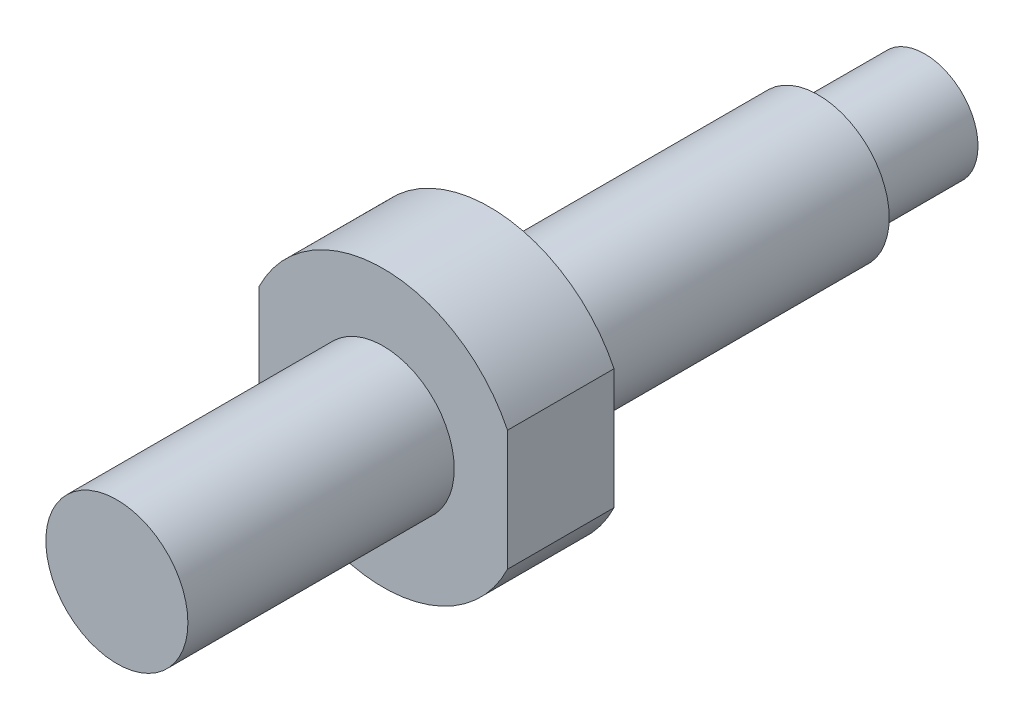
ISO-10303-21;
HEADER;
FILE_DESCRIPTION(('STEP AP214'),'2;1');
FILE_NAME('part.step','',(''),(''),'','','');
FILE_SCHEMA(('AUTOMOTIVE_DESIGN { 1 0 10303 214 1 1 1 1 }'));
ENDSEC;
DATA;
#1=APPLICATION_CONTEXT('core data for automotive mechanical design processes');
#2=APPLICATION_PROTOCOL_DEFINITION('international standard','automotive_design',2000,#1);
#3=PRODUCT_CONTEXT('',#1,'mechanical');
#4=PRODUCT('Part','Part','',(#3));
#5=PRODUCT_RELATED_PRODUCT_CATEGORY('part','',(#4));
#6=PRODUCT_DEFINITION_FORMATION('','',#4);
#7=PRODUCT_DEFINITION_CONTEXT('part definition',#1,'design');
#8=PRODUCT_DEFINITION('design','',#6,#7);
#9=PRODUCT_DEFINITION_SHAPE('','',#8);
#10=(LENGTH_UNIT() NAMED_UNIT(*) SI_UNIT(.MILLI.,.METRE.));
#11=(NAMED_UNIT(*) PLANE_ANGLE_UNIT() SI_UNIT($,.RADIAN.));
#12=(NAMED_UNIT(*) SI_UNIT($,.STERADIAN.) SOLID_ANGLE_UNIT());
#13=UNCERTAINTY_MEASURE_WITH_UNIT(LENGTH_MEASURE(1.E-05),#10,'distance_accuracy_value','');
#14=(GEOMETRIC_REPRESENTATION_CONTEXT(3) GLOBAL_UNCERTAINTY_ASSIGNED_CONTEXT((#13)) GLOBAL_UNIT_ASSIGNED_CONTEXT((#10,
#11,#12)) REPRESENTATION_CONTEXT('',''));
#15=CARTESIAN_POINT('',(0.,0.,0.));
#16=DIRECTION('',(0.,0.,1.));
#17=DIRECTION('',(1.,0.,0.));
#18=AXIS2_PLACEMENT_3D('',#15,#16,#17);
#19=CARTESIAN_POINT('',(0.,4.,-39.5));
#20=DIRECTION('',(0.,0.,1.));
#21=DIRECTION('',(1.,0.,0.));
#22=AXIS2_PLACEMENT_3D('',#19,#20,#21);
#23=PLANE('',#22);
#24=CARTESIAN_POINT('',(0.,0.,-39.5));
#25=DIRECTION('',(0.,0.,1.));
#26=DIRECTION('',(1.,0.,0.));
#27=AXIS2_PLACEMENT_3D('',#24,#25,#26);
#28=CIRCLE('',#27,4.);
#29=CARTESIAN_POINT('',(4.,0.,-39.5));
#30=VERTEX_POINT('',#29);
#31=EDGE_CURVE('E125',#30,#30,#28,.T.);
#32=ORIENTED_EDGE('',*,*,#31,.F.);
#33=EDGE_LOOP('',(#32));
#34=FACE_BOUND('',#33,.T.);
#35=CARTESIAN_POINT('',(0.,0.,-39.5));
#36=DIRECTION('',(0.,0.,1.));
#37=DIRECTION('',(1.,0.,0.));
#38=AXIS2_PLACEMENT_3D('',#35,#36,#37);
#39=CIRCLE('',#38,3.);
#40=CARTESIAN_POINT('',(3.,0.,-39.5));
#41=VERTEX_POINT('',#40);
#42=EDGE_CURVE('E12',#41,#41,#39,.F.);
#43=ORIENTED_EDGE('',*,*,#42,.F.);
#44=EDGE_LOOP('',(#43));
#45=FACE_BOUND('',#44,.T.);
#46=ADVANCED_FACE('F40',(#34,#45),#23,.F.);
#47=CARTESIAN_POINT('',(0.,4.,-15.));
#48=DIRECTION('',(0.,0.,-1.));
#49=DIRECTION('',(-1.,0.,0.));
#50=AXIS2_PLACEMENT_3D('',#47,#48,#49);
#51=PLANE('',#50);
#52=CARTESIAN_POINT('',(0.,0.,-15.));
#53=DIRECTION('',(0.,0.,1.));
#54=DIRECTION('',(1.,0.,0.));
#55=AXIS2_PLACEMENT_3D('',#52,#53,#54);
#56=CIRCLE('',#55,4.);
#57=CARTESIAN_POINT('',(4.,0.,-15.));
#58=VERTEX_POINT('',#57);
#59=EDGE_CURVE('E106',#58,#58,#56,.T.);
#60=ORIENTED_EDGE('',*,*,#59,.F.);
#61=EDGE_LOOP('',(#60));
#62=FACE_BOUND('',#61,.T.);
#63=CARTESIAN_POINT('',(0.,0.,-15.));
#64=DIRECTION('',(0.,0.,-1.));
#65=DIRECTION('',(-1.,0.,0.));
#66=AXIS2_PLACEMENT_3D('',#63,#64,#65);
#67=CIRCLE('',#66,7.77784742024014);
#68=CARTESIAN_POINT('',(-7.,3.39041450158181,-15.));
#69=VERTEX_POINT('',#68);
#70=CARTESIAN_POINT('',(7.,3.39041450158181,-15.));
#71=VERTEX_POINT('',#70);
#72=EDGE_CURVE('E82',#69,#71,#67,.T.);
#73=ORIENTED_EDGE('',*,*,#72,.F.);
#74=DIRECTION('',(0.,1.,0.));
#75=VECTOR('',#74,1.);
#76=CARTESIAN_POINT('',(-7.,-8.43799237337698,-15.));
#77=LINE('',#76,#75);
#78=CARTESIAN_POINT('',(-7.,-3.39041450158181,-15.));
#79=VERTEX_POINT('',#78);
#80=EDGE_CURVE('E116',#79,#69,#77,.T.);
#81=ORIENTED_EDGE('',*,*,#80,.F.);
#82=CARTESIAN_POINT('',(7.,-3.39041450158181,-15.));
#83=VERTEX_POINT('',#82);
#84=EDGE_CURVE('E55',#83,#79,#67,.T.);
#85=ORIENTED_EDGE('',*,*,#84,.F.);
#86=DIRECTION('',(0.,-1.,0.));
#87=VECTOR('',#86,1.);
#88=CARTESIAN_POINT('',(7.,-8.43799237337698,-15.));
#89=LINE('',#88,#87);
#90=EDGE_CURVE('E119',#71,#83,#89,.T.);
#91=ORIENTED_EDGE('',*,*,#90,.F.);
#92=EDGE_LOOP('',(#73,#81,#85,#91));
#93=FACE_BOUND('',#92,.T.);
#94=ADVANCED_FACE('F118',(#62,#93),#51,.F.);
#95=CARTESIAN_POINT('',(0.,9.,-21.));
#96=DIRECTION('',(0.,0.,1.));
#97=DIRECTION('',(1.,0.,0.));
#98=AXIS2_PLACEMENT_3D('',#95,#96,#97);
#99=PLANE('',#98);
#100=CARTESIAN_POINT('',(0.,0.,-21.));
#101=DIRECTION('',(0.,0.,1.));
#102=DIRECTION('',(1.,0.,0.));
#103=AXIS2_PLACEMENT_3D('',#100,#101,#102);
#104=CIRCLE('',#103,4.);
#105=CARTESIAN_POINT('',(4.,0.,-21.));
#106=VERTEX_POINT('',#105);
#107=EDGE_CURVE('E128',#106,#106,#104,.T.);
#108=ORIENTED_EDGE('',*,*,#107,.T.);
#109=EDGE_LOOP('',(#108));
#110=FACE_BOUND('',#109,.T.);
#111=CARTESIAN_POINT('',(0.,0.,-21.));
#112=DIRECTION('',(0.,0.,-1.));
#113=DIRECTION('',(-1.,0.,0.));
#114=AXIS2_PLACEMENT_3D('',#111,#112,#113);
#115=CIRCLE('',#114,7.77784742024014);
#116=CARTESIAN_POINT('',(-7.,3.39041450158181,-21.));
#117=VERTEX_POINT('',#116);
#118=CARTESIAN_POINT('',(7.,3.39041450158181,-21.));
#119=VERTEX_POINT('',#118);
#120=EDGE_CURVE('E63',#117,#119,#115,.T.);
#121=ORIENTED_EDGE('',*,*,#120,.T.);
#122=DIRECTION('',(0.,-1.,0.));
#123=VECTOR('',#122,1.);
#124=CARTESIAN_POINT('',(7.,9.,-21.));
#125=LINE('',#124,#123);
#126=CARTESIAN_POINT('',(7.,-3.39041450158181,-21.));
#127=VERTEX_POINT('',#126);
#128=EDGE_CURVE('E93',#119,#127,#125,.T.);
#129=ORIENTED_EDGE('',*,*,#128,.T.);
#130=CARTESIAN_POINT('',(-7.,-3.39041450158181,-21.));
#131=VERTEX_POINT('',#130);
#132=EDGE_CURVE('E96',#127,#131,#115,.T.);
#133=ORIENTED_EDGE('',*,*,#132,.T.);
#134=DIRECTION('',(0.,1.,0.));
#135=VECTOR('',#134,1.);
#136=CARTESIAN_POINT('',(-7.,9.,-21.));
#137=LINE('',#136,#135);
#138=EDGE_CURVE('E95',#131,#117,#137,.T.);
#139=ORIENTED_EDGE('',*,*,#138,.T.);
#140=EDGE_LOOP('',(#121,#129,#133,#139));
#141=FACE_BOUND('',#140,.T.);
#142=ADVANCED_FACE('F91',(#110,#141),#99,.F.);
#143=CARTESIAN_POINT('',(7.,-8.43799237337698,-25.));
#144=DIRECTION('',(-1.,0.,0.));
#145=DIRECTION('',(0.,0.,1.));
#146=AXIS2_PLACEMENT_3D('',#143,#144,#145);
#147=PLANE('',#146);
#148=DIRECTION('',(0.,0.,-1.));
#149=VECTOR('',#148,1.);
#150=CARTESIAN_POINT('',(7.,3.39041450158181,-11.));
#151=LINE('',#150,#149);
#152=EDGE_CURVE('E79',#71,#119,#151,.T.);
#153=ORIENTED_EDGE('',*,*,#152,.F.);
#154=ORIENTED_EDGE('',*,*,#90,.T.);
#155=DIRECTION('',(0.,0.,-1.));
#156=VECTOR('',#155,1.);
#157=CARTESIAN_POINT('',(7.,-3.39041450158181,-11.));
#158=LINE('',#157,#156);
#159=EDGE_CURVE('E100',#127,#83,#158,.F.);
#160=ORIENTED_EDGE('',*,*,#159,.F.);
#161=ORIENTED_EDGE('',*,*,#128,.F.);
#162=EDGE_LOOP('',(#153,#154,#160,#161));
#163=FACE_BOUND('',#162,.T.);
#164=ADVANCED_FACE('F99',(#163),#147,.F.);
#165=CARTESIAN_POINT('',(-7.,-8.43799237337698,-25.));
#166=DIRECTION('',(1.,0.,0.));
#167=DIRECTION('',(0.,0.,-1.));
#168=AXIS2_PLACEMENT_3D('',#165,#166,#167);
#169=PLANE('',#168);
#170=DIRECTION('',(0.,0.,-1.));
#171=VECTOR('',#170,1.);
#172=CARTESIAN_POINT('',(-7.,-3.39041450158181,-11.));
#173=LINE('',#172,#171);
#174=EDGE_CURVE('E48',#79,#131,#173,.T.);
#175=ORIENTED_EDGE('',*,*,#174,.F.);
#176=ORIENTED_EDGE('',*,*,#80,.T.);
#177=DIRECTION('',(0.,0.,-1.));
#178=VECTOR('',#177,1.);
#179=CARTESIAN_POINT('',(-7.,3.39041450158181,-11.));
#180=LINE('',#179,#178);
#181=EDGE_CURVE('E103',#117,#69,#180,.F.);
#182=ORIENTED_EDGE('',*,*,#181,.F.);
#183=ORIENTED_EDGE('',*,*,#138,.F.);
#184=EDGE_LOOP('',(#175,#176,#182,#183));
#185=FACE_BOUND('',#184,.T.);
#186=ADVANCED_FACE('F115',(#185),#169,.F.);
#187=CARTESIAN_POINT('',(0.,0.,0.));
#188=DIRECTION('',(0.,0.,-1.));
#189=DIRECTION('',(-1.,0.,0.));
#190=AXIS2_PLACEMENT_3D('',#187,#188,#189);
#191=PLANE('',#190);
#192=CARTESIAN_POINT('',(0.,0.,0.));
#193=DIRECTION('',(0.,0.,1.));
#194=DIRECTION('',(1.,0.,0.));
#195=AXIS2_PLACEMENT_3D('',#192,#193,#194);
#196=CIRCLE('',#195,4.);
#197=CARTESIAN_POINT('',(4.,0.,0.));
#198=VERTEX_POINT('',#197);
#199=EDGE_CURVE('E101',#198,#198,#196,.T.);
#200=ORIENTED_EDGE('',*,*,#199,.T.);
#201=EDGE_LOOP('',(#200));
#202=FACE_BOUND('',#201,.T.);
#203=ADVANCED_FACE('F42',(#202),#191,.F.);
#204=CARTESIAN_POINT('',(0.,0.,0.));
#205=DIRECTION('',(0.,0.,1.));
#206=DIRECTION('',(1.,0.,0.));
#207=AXIS2_PLACEMENT_3D('',#204,#205,#206);
#208=CYLINDRICAL_SURFACE('',#207,4.);
#209=ORIENTED_EDGE('',*,*,#199,.F.);
#210=EDGE_LOOP('',(#209));
#211=FACE_BOUND('',#210,.T.);
#212=ORIENTED_EDGE('',*,*,#59,.T.);
#213=EDGE_LOOP('',(#212));
#214=FACE_BOUND('',#213,.T.);
#215=ADVANCED_FACE('F133',(#211,#214),#208,.T.);
#216=CARTESIAN_POINT('',(0.,0.,0.));
#217=DIRECTION('',(0.,0.,1.));
#218=DIRECTION('',(1.,0.,0.));
#219=AXIS2_PLACEMENT_3D('',#216,#217,#218);
#220=CYLINDRICAL_SURFACE('',#219,4.);
#221=ORIENTED_EDGE('',*,*,#107,.F.);
#222=EDGE_LOOP('',(#221));
#223=FACE_BOUND('',#222,.T.);
#224=ORIENTED_EDGE('',*,*,#31,.T.);
#225=EDGE_LOOP('',(#224));
#226=FACE_BOUND('',#225,.T.);
#227=ADVANCED_FACE('F147',(#223,#226),#220,.T.);
#228=CARTESIAN_POINT('',(0.,0.,-11.));
#229=DIRECTION('',(0.,0.,-1.));
#230=DIRECTION('',(-1.,0.,0.));
#231=AXIS2_PLACEMENT_3D('',#228,#229,#230);
#232=CYLINDRICAL_SURFACE('',#231,7.77784742024014);
#233=ORIENTED_EDGE('',*,*,#152,.T.);
#234=ORIENTED_EDGE('',*,*,#120,.F.);
#235=ORIENTED_EDGE('',*,*,#181,.T.);
#236=ORIENTED_EDGE('',*,*,#72,.T.);
#237=EDGE_LOOP('',(#233,#234,#235,#236));
#238=FACE_BOUND('',#237,.T.);
#239=ADVANCED_FACE('F80',(#238),#232,.T.);
#240=ORIENTED_EDGE('',*,*,#159,.T.);
#241=ORIENTED_EDGE('',*,*,#84,.T.);
#242=ORIENTED_EDGE('',*,*,#174,.T.);
#243=ORIENTED_EDGE('',*,*,#132,.F.);
#244=EDGE_LOOP('',(#240,#241,#242,#243));
#245=FACE_BOUND('',#244,.T.);
#246=ADVANCED_FACE('F110',(#245),#232,.T.);
#247=CARTESIAN_POINT('',(0.,0.,-45.5));
#248=DIRECTION('',(0.,0.,1.));
#249=DIRECTION('',(1.,0.,0.));
#250=AXIS2_PLACEMENT_3D('',#247,#248,#249);
#251=CYLINDRICAL_SURFACE('',#250,3.);
#252=CARTESIAN_POINT('',(0.,0.,-45.5));
#253=DIRECTION('',(0.,0.,-1.));
#254=DIRECTION('',(-1.,0.,0.));
#255=AXIS2_PLACEMENT_3D('',#252,#253,#254);
#256=CIRCLE('',#255,3.);
#257=CARTESIAN_POINT('',(-3.,0.,-45.5));
#258=VERTEX_POINT('',#257);
#259=EDGE_CURVE('E114',#258,#258,#256,.T.);
#260=ORIENTED_EDGE('',*,*,#259,.F.);
#261=EDGE_LOOP('',(#260));
#262=FACE_BOUND('',#261,.T.);
#263=ORIENTED_EDGE('',*,*,#42,.T.);
#264=EDGE_LOOP('',(#263));
#265=FACE_BOUND('',#264,.T.);
#266=ADVANCED_FACE('F167',(#262,#265),#251,.T.);
#267=CARTESIAN_POINT('',(0.,0.,-45.5));
#268=DIRECTION('',(0.,0.,-1.));
#269=DIRECTION('',(-1.,0.,0.));
#270=AXIS2_PLACEMENT_3D('',#267,#268,#269);
#271=PLANE('',#270);
#272=ORIENTED_EDGE('',*,*,#259,.T.);
#273=EDGE_LOOP('',(#272));
#274=FACE_BOUND('',#273,.T.);
#275=ADVANCED_FACE('F170',(#274),#271,.T.);
#276=CLOSED_SHELL('',(#46,#94,#142,#164,#186,#203,#215,#227,#239,#246,#266,#275));
#277=MANIFOLD_SOLID_BREP('B2',#276);
#278=ADVANCED_BREP_SHAPE_REPRESENTATION('',(#18,#277),#14);
#279=SHAPE_DEFINITION_REPRESENTATION(#9,#278);
ENDSEC;
END-ISO-10303-21;
